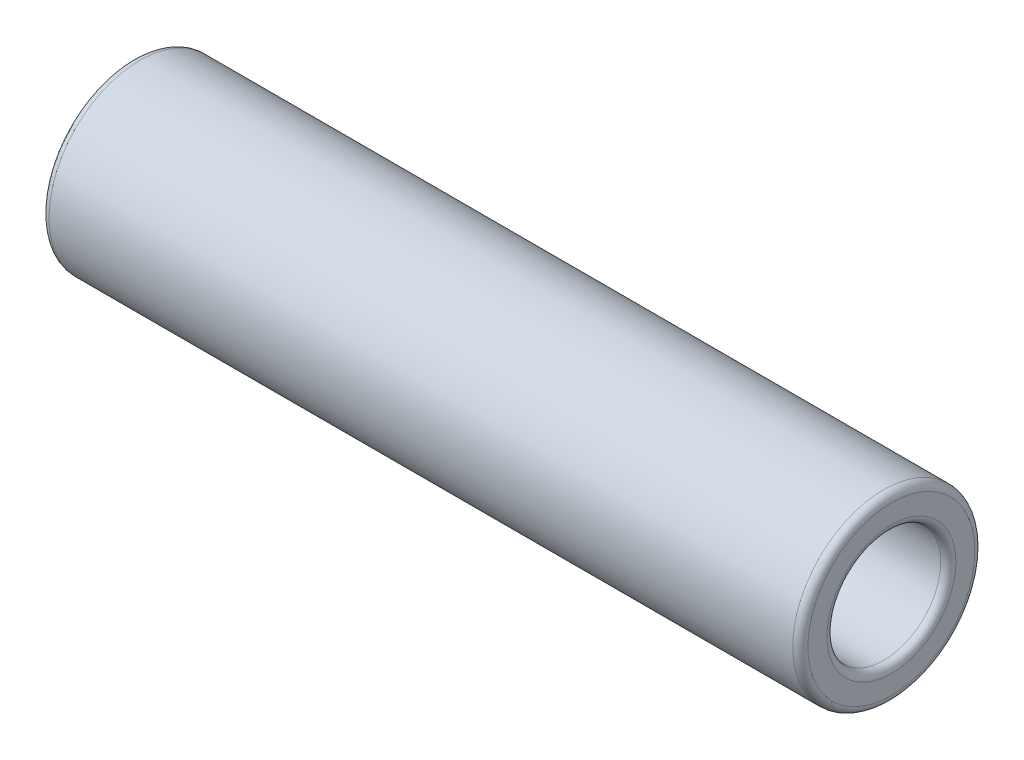
ISO-10303-21;
HEADER;
FILE_DESCRIPTION(('STEP AP214'),'2;1');
FILE_NAME('part.step','',(''),(''),'','','');
FILE_SCHEMA(('AUTOMOTIVE_DESIGN { 1 0 10303 214 1 1 1 1 }'));
ENDSEC;
DATA;
#1=APPLICATION_CONTEXT('core data for automotive mechanical design processes');
#2=APPLICATION_PROTOCOL_DEFINITION('international standard','automotive_design',2000,#1);
#3=PRODUCT_CONTEXT('',#1,'mechanical');
#4=PRODUCT('Part','Part','',(#3));
#5=PRODUCT_RELATED_PRODUCT_CATEGORY('part','',(#4));
#6=PRODUCT_DEFINITION_FORMATION('','',#4);
#7=PRODUCT_DEFINITION_CONTEXT('part definition',#1,'design');
#8=PRODUCT_DEFINITION('design','',#6,#7);
#9=PRODUCT_DEFINITION_SHAPE('','',#8);
#10=(LENGTH_UNIT() NAMED_UNIT(*) SI_UNIT(.MILLI.,.METRE.));
#11=(NAMED_UNIT(*) PLANE_ANGLE_UNIT() SI_UNIT($,.RADIAN.));
#12=(NAMED_UNIT(*) SI_UNIT($,.STERADIAN.) SOLID_ANGLE_UNIT());
#13=UNCERTAINTY_MEASURE_WITH_UNIT(LENGTH_MEASURE(1.E-05),#10,'distance_accuracy_value','');
#14=(GEOMETRIC_REPRESENTATION_CONTEXT(3) GLOBAL_UNCERTAINTY_ASSIGNED_CONTEXT((#13)) GLOBAL_UNIT_ASSIGNED_CONTEXT((#10,
#11,#12)) REPRESENTATION_CONTEXT('',''));
#15=CARTESIAN_POINT('',(0.,0.,0.));
#16=DIRECTION('',(0.,0.,1.));
#17=DIRECTION('',(1.,0.,0.));
#18=AXIS2_PLACEMENT_3D('',#15,#16,#17);
#19=CARTESIAN_POINT('',(50.,0.,0.));
#20=DIRECTION('',(1.,0.,0.));
#21=DIRECTION('',(0.,0.,-1.));
#22=AXIS2_PLACEMENT_3D('',#19,#20,#21);
#23=PLANE('',#22);
#24=CARTESIAN_POINT('',(50.,0.,0.));
#25=DIRECTION('',(1.,0.,0.));
#26=DIRECTION('',(0.,0.,-1.));
#27=AXIS2_PLACEMENT_3D('',#24,#25,#26);
#28=CIRCLE('',#27,4.25);
#29=CARTESIAN_POINT('',(50.,0.,-4.25));
#30=VERTEX_POINT('',#29);
#31=EDGE_CURVE('E53',#30,#30,#28,.F.);
#32=ORIENTED_EDGE('',*,*,#31,.T.);
#33=EDGE_LOOP('',(#32));
#34=FACE_BOUND('',#33,.T.);
#35=CARTESIAN_POINT('',(50.,0.,0.));
#36=DIRECTION('',(1.,0.,0.));
#37=DIRECTION('',(0.,0.,-1.));
#38=AXIS2_PLACEMENT_3D('',#35,#36,#37);
#39=CIRCLE('',#38,5.5);
#40=CARTESIAN_POINT('',(50.,0.,-5.5));
#41=VERTEX_POINT('',#40);
#42=EDGE_CURVE('E56',#41,#41,#39,.T.);
#43=ORIENTED_EDGE('',*,*,#42,.T.);
#44=EDGE_LOOP('',(#43));
#45=FACE_BOUND('',#44,.T.);
#46=ADVANCED_FACE('F33',(#34,#45),#23,.T.);
#47=CARTESIAN_POINT('',(0.,0.,0.));
#48=DIRECTION('',(1.,0.,0.));
#49=DIRECTION('',(0.,0.,-1.));
#50=AXIS2_PLACEMENT_3D('',#47,#48,#49);
#51=PLANE('',#50);
#52=CARTESIAN_POINT('',(0.,0.,0.));
#53=DIRECTION('',(1.,0.,0.));
#54=DIRECTION('',(0.,0.,-1.));
#55=AXIS2_PLACEMENT_3D('',#52,#53,#54);
#56=CIRCLE('',#55,4.25);
#57=CARTESIAN_POINT('',(0.,0.,-4.25));
#58=VERTEX_POINT('',#57);
#59=EDGE_CURVE('E10',#58,#58,#56,.T.);
#60=ORIENTED_EDGE('',*,*,#59,.T.);
#61=EDGE_LOOP('',(#60));
#62=FACE_BOUND('',#61,.T.);
#63=CARTESIAN_POINT('',(0.,0.,0.));
#64=DIRECTION('',(1.,0.,0.));
#65=DIRECTION('',(0.,0.,-1.));
#66=AXIS2_PLACEMENT_3D('',#63,#64,#65);
#67=CIRCLE('',#66,5.5);
#68=CARTESIAN_POINT('',(0.,0.,-5.5));
#69=VERTEX_POINT('',#68);
#70=EDGE_CURVE('E40',#69,#69,#67,.F.);
#71=ORIENTED_EDGE('',*,*,#70,.T.);
#72=EDGE_LOOP('',(#71));
#73=FACE_BOUND('',#72,.T.);
#74=ADVANCED_FACE('F81',(#62,#73),#51,.F.);
#75=CARTESIAN_POINT('',(50.,0.,0.));
#76=DIRECTION('',(-1.,0.,0.));
#77=DIRECTION('',(0.,0.,1.));
#78=AXIS2_PLACEMENT_3D('',#75,#76,#77);
#79=CYLINDRICAL_SURFACE('',#78,6.);
#80=CARTESIAN_POINT('',(49.5,0.,0.));
#81=DIRECTION('',(1.,0.,0.));
#82=DIRECTION('',(0.,0.,-1.));
#83=AXIS2_PLACEMENT_3D('',#80,#81,#82);
#84=CIRCLE('',#83,6.);
#85=CARTESIAN_POINT('',(49.5,0.,-6.));
#86=VERTEX_POINT('',#85);
#87=EDGE_CURVE('E44',#86,#86,#84,.F.);
#88=ORIENTED_EDGE('',*,*,#87,.T.);
#89=EDGE_LOOP('',(#88));
#90=FACE_BOUND('',#89,.T.);
#91=CARTESIAN_POINT('',(0.5,0.,0.));
#92=DIRECTION('',(1.,0.,0.));
#93=DIRECTION('',(0.,0.,-1.));
#94=AXIS2_PLACEMENT_3D('',#91,#92,#93);
#95=CIRCLE('',#94,6.);
#96=CARTESIAN_POINT('',(0.5,0.,-6.));
#97=VERTEX_POINT('',#96);
#98=EDGE_CURVE('E48',#97,#97,#95,.T.);
#99=ORIENTED_EDGE('',*,*,#98,.T.);
#100=EDGE_LOOP('',(#99));
#101=FACE_BOUND('',#100,.T.);
#102=ADVANCED_FACE('F87',(#90,#101),#79,.T.);
#103=CARTESIAN_POINT('',(50.,0.,0.));
#104=DIRECTION('',(-1.,0.,0.));
#105=DIRECTION('',(0.,0.,1.));
#106=AXIS2_PLACEMENT_3D('',#103,#104,#105);
#107=CYLINDRICAL_SURFACE('',#106,3.75);
#108=CARTESIAN_POINT('',(49.5,0.,0.));
#109=DIRECTION('',(1.,0.,0.));
#110=DIRECTION('',(0.,0.,-1.));
#111=AXIS2_PLACEMENT_3D('',#108,#109,#110);
#112=CIRCLE('',#111,3.75);
#113=CARTESIAN_POINT('',(49.5,0.,-3.75));
#114=VERTEX_POINT('',#113);
#115=EDGE_CURVE('E59',#114,#114,#112,.T.);
#116=ORIENTED_EDGE('',*,*,#115,.T.);
#117=EDGE_LOOP('',(#116));
#118=FACE_BOUND('',#117,.T.);
#119=CARTESIAN_POINT('',(0.5,0.,0.));
#120=DIRECTION('',(1.,0.,0.));
#121=DIRECTION('',(0.,0.,-1.));
#122=AXIS2_PLACEMENT_3D('',#119,#120,#121);
#123=CIRCLE('',#122,3.75);
#124=CARTESIAN_POINT('',(0.5,0.,-3.75));
#125=VERTEX_POINT('',#124);
#126=EDGE_CURVE('E62',#125,#125,#123,.F.);
#127=ORIENTED_EDGE('',*,*,#126,.T.);
#128=EDGE_LOOP('',(#127));
#129=FACE_BOUND('',#128,.T.);
#130=ADVANCED_FACE('F66',(#118,#129),#107,.F.);
#131=CARTESIAN_POINT('',(49.5,0.,0.));
#132=DIRECTION('',(1.,0.,0.));
#133=DIRECTION('',(0.,0.,-1.));
#134=AXIS2_PLACEMENT_3D('',#131,#132,#133);
#135=TOROIDAL_SURFACE('',#134,4.25,0.5);
#136=ORIENTED_EDGE('',*,*,#31,.F.);
#137=EDGE_LOOP('',(#136));
#138=FACE_BOUND('',#137,.T.);
#139=ORIENTED_EDGE('',*,*,#115,.F.);
#140=EDGE_LOOP('',(#139));
#141=FACE_BOUND('',#140,.T.);
#142=ADVANCED_FACE('F77',(#138,#141),#135,.T.);
#143=CARTESIAN_POINT('',(49.5,0.,0.));
#144=DIRECTION('',(1.,0.,0.));
#145=DIRECTION('',(0.,0.,-1.));
#146=AXIS2_PLACEMENT_3D('',#143,#144,#145);
#147=TOROIDAL_SURFACE('',#146,5.5,0.5);
#148=ORIENTED_EDGE('',*,*,#87,.F.);
#149=EDGE_LOOP('',(#148));
#150=FACE_BOUND('',#149,.T.);
#151=ORIENTED_EDGE('',*,*,#42,.F.);
#152=EDGE_LOOP('',(#151));
#153=FACE_BOUND('',#152,.T.);
#154=ADVANCED_FACE('F71',(#150,#153),#147,.T.);
#155=CARTESIAN_POINT('',(0.5,0.,0.));
#156=DIRECTION('',(1.,0.,0.));
#157=DIRECTION('',(0.,0.,-1.));
#158=AXIS2_PLACEMENT_3D('',#155,#156,#157);
#159=TOROIDAL_SURFACE('',#158,4.25,0.5);
#160=ORIENTED_EDGE('',*,*,#126,.F.);
#161=EDGE_LOOP('',(#160));
#162=FACE_BOUND('',#161,.T.);
#163=ORIENTED_EDGE('',*,*,#59,.F.);
#164=EDGE_LOOP('',(#163));
#165=FACE_BOUND('',#164,.T.);
#166=ADVANCED_FACE('F68',(#162,#165),#159,.T.);
#167=CARTESIAN_POINT('',(0.5,0.,0.));
#168=DIRECTION('',(1.,0.,0.));
#169=DIRECTION('',(0.,0.,-1.));
#170=AXIS2_PLACEMENT_3D('',#167,#168,#169);
#171=TOROIDAL_SURFACE('',#170,5.5,0.5);
#172=ORIENTED_EDGE('',*,*,#70,.F.);
#173=EDGE_LOOP('',(#172));
#174=FACE_BOUND('',#173,.T.);
#175=ORIENTED_EDGE('',*,*,#98,.F.);
#176=EDGE_LOOP('',(#175));
#177=FACE_BOUND('',#176,.T.);
#178=ADVANCED_FACE('F35',(#174,#177),#171,.T.);
#179=CLOSED_SHELL('',(#46,#74,#102,#130,#142,#154,#166,#178));
#180=MANIFOLD_SOLID_BREP('B2',#179);
#181=ADVANCED_BREP_SHAPE_REPRESENTATION('',(#18,#180),#14);
#182=SHAPE_DEFINITION_REPRESENTATION(#9,#181);
ENDSEC;
END-ISO-10303-21;
